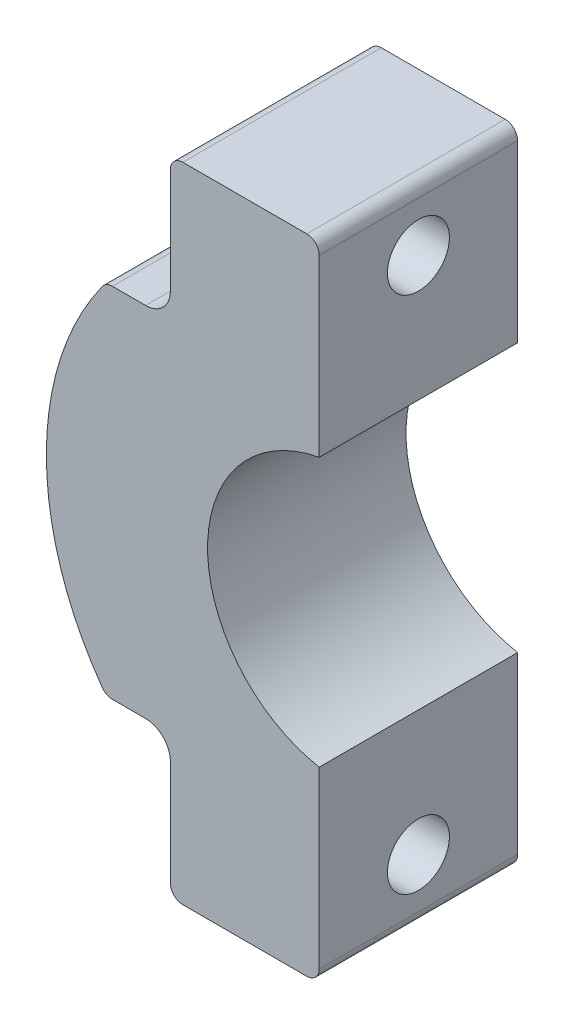
ISO-10303-21;
HEADER;
FILE_DESCRIPTION(('STEP AP214'),'2;1');
FILE_NAME('part.step','',(''),(''),'','','');
FILE_SCHEMA(('AUTOMOTIVE_DESIGN { 1 0 10303 214 1 1 1 1 }'));
ENDSEC;
DATA;
#1=APPLICATION_CONTEXT('core data for automotive mechanical design processes');
#2=APPLICATION_PROTOCOL_DEFINITION('international standard','automotive_design',2000,#1);
#3=PRODUCT_CONTEXT('',#1,'mechanical');
#4=PRODUCT('Part','Part','',(#3));
#5=PRODUCT_RELATED_PRODUCT_CATEGORY('part','',(#4));
#6=PRODUCT_DEFINITION_FORMATION('','',#4);
#7=PRODUCT_DEFINITION_CONTEXT('part definition',#1,'design');
#8=PRODUCT_DEFINITION('design','',#6,#7);
#9=PRODUCT_DEFINITION_SHAPE('','',#8);
#10=(LENGTH_UNIT() NAMED_UNIT(*) SI_UNIT(.MILLI.,.METRE.));
#11=(NAMED_UNIT(*) PLANE_ANGLE_UNIT() SI_UNIT($,.RADIAN.));
#12=(NAMED_UNIT(*) SI_UNIT($,.STERADIAN.) SOLID_ANGLE_UNIT());
#13=UNCERTAINTY_MEASURE_WITH_UNIT(LENGTH_MEASURE(1.E-05),#10,'distance_accuracy_value','');
#14=(GEOMETRIC_REPRESENTATION_CONTEXT(3) GLOBAL_UNCERTAINTY_ASSIGNED_CONTEXT((#13)) GLOBAL_UNIT_ASSIGNED_CONTEXT((#10,
#11,#12)) REPRESENTATION_CONTEXT('',''));
#15=CARTESIAN_POINT('',(0.,0.,0.));
#16=DIRECTION('',(0.,0.,1.));
#17=DIRECTION('',(1.,0.,0.));
#18=AXIS2_PLACEMENT_3D('',#15,#16,#17);
#19=CARTESIAN_POINT('',(0.,0.,8.));
#20=DIRECTION('',(0.,0.,1.));
#21=DIRECTION('',(1.,0.,0.));
#22=AXIS2_PLACEMENT_3D('',#19,#20,#21);
#23=PLANE('',#22);
#24=DIRECTION('',(-1.,0.,0.));
#25=VECTOR('',#24,1.);
#26=CARTESIAN_POINT('',(-7.,-12.9614813968157,8.));
#27=LINE('',#26,#25);
#28=CARTESIAN_POINT('',(-1.5,-12.9614813968157,8.));
#29=VERTEX_POINT('',#28);
#30=CARTESIAN_POINT('',(-6.5,-12.9614813968157,8.));
#31=VERTEX_POINT('',#30);
#32=EDGE_CURVE('E277',#29,#31,#27,.T.);
#33=ORIENTED_EDGE('',*,*,#32,.F.);
#34=CARTESIAN_POINT('',(-1.5,-12.4614813968157,8.));
#35=DIRECTION('',(0.,0.,1.));
#36=DIRECTION('',(1.,0.,0.));
#37=AXIS2_PLACEMENT_3D('',#34,#35,#36);
#38=CIRCLE('',#37,0.5);
#39=CARTESIAN_POINT('',(-1.,-12.4614813968157,8.));
#40=VERTEX_POINT('',#39);
#41=EDGE_CURVE('E177',#29,#40,#38,.T.);
#42=ORIENTED_EDGE('',*,*,#41,.T.);
#43=DIRECTION('',(0.,-1.,0.));
#44=VECTOR('',#43,1.);
#45=CARTESIAN_POINT('',(-1.,24.2431667663396,8.));
#46=LINE('',#45,#44);
#47=CARTESIAN_POINT('',(-1.,-5.40832691319598,8.));
#48=VERTEX_POINT('',#47);
#49=EDGE_CURVE('E162',#48,#40,#46,.T.);
#50=ORIENTED_EDGE('',*,*,#49,.F.);
#51=CARTESIAN_POINT('',(0.,0.,8.));
#52=DIRECTION('',(0.,0.,1.));
#53=DIRECTION('',(1.,0.,0.));
#54=AXIS2_PLACEMENT_3D('',#51,#52,#53);
#55=CIRCLE('',#54,5.5);
#56=CARTESIAN_POINT('',(-1.,5.40832691319598,8.));
#57=VERTEX_POINT('',#56);
#58=EDGE_CURVE('E171',#57,#48,#55,.T.);
#59=ORIENTED_EDGE('',*,*,#58,.F.);
#60=CARTESIAN_POINT('',(-1.,12.4614813968157,8.));
#61=VERTEX_POINT('',#60);
#62=EDGE_CURVE('E178',#61,#57,#46,.T.);
#63=ORIENTED_EDGE('',*,*,#62,.F.);
#64=CARTESIAN_POINT('',(-1.5,12.4614813968157,8.));
#65=DIRECTION('',(0.,0.,1.));
#66=DIRECTION('',(1.,0.,0.));
#67=AXIS2_PLACEMENT_3D('',#64,#65,#66);
#68=CIRCLE('',#67,0.5);
#69=CARTESIAN_POINT('',(-1.5,12.9614813968157,8.));
#70=VERTEX_POINT('',#69);
#71=EDGE_CURVE('E259',#61,#70,#68,.T.);
#72=ORIENTED_EDGE('',*,*,#71,.T.);
#73=DIRECTION('',(1.,0.,0.));
#74=VECTOR('',#73,1.);
#75=CARTESIAN_POINT('',(-7.,12.9614813968157,8.));
#76=LINE('',#75,#74);
#77=CARTESIAN_POINT('',(-6.5,12.9614813968157,8.));
#78=VERTEX_POINT('',#77);
#79=EDGE_CURVE('E273',#78,#70,#76,.T.);
#80=ORIENTED_EDGE('',*,*,#79,.F.);
#81=CARTESIAN_POINT('',(-6.5,12.4614813968157,8.));
#82=DIRECTION('',(0.,0.,1.));
#83=DIRECTION('',(1.,0.,0.));
#84=AXIS2_PLACEMENT_3D('',#81,#82,#83);
#85=CIRCLE('',#84,0.5);
#86=CARTESIAN_POINT('',(-7.,12.4614813968157,8.));
#87=VERTEX_POINT('',#86);
#88=EDGE_CURVE('E227',#78,#87,#85,.T.);
#89=ORIENTED_EDGE('',*,*,#88,.T.);
#90=DIRECTION('',(0.,1.,0.));
#91=VECTOR('',#90,1.);
#92=CARTESIAN_POINT('',(-7.,21.0444914195402,8.));
#93=LINE('',#92,#91);
#94=CARTESIAN_POINT('',(-7.,8.21148139681573,8.));
#95=VERTEX_POINT('',#94);
#96=EDGE_CURVE('E293',#95,#87,#93,.T.);
#97=ORIENTED_EDGE('',*,*,#96,.F.);
#98=CARTESIAN_POINT('',(-8.,8.21148139681572,8.));
#99=DIRECTION('',(0.,0.,1.));
#100=DIRECTION('',(1.,0.,0.));
#101=AXIS2_PLACEMENT_3D('',#98,#99,#100);
#102=CIRCLE('',#101,1.);
#103=CARTESIAN_POINT('',(-8.,7.21148139681572,8.));
#104=VERTEX_POINT('',#103);
#105=EDGE_CURVE('E252',#95,#104,#102,.F.);
#106=ORIENTED_EDGE('',*,*,#105,.T.);
#107=DIRECTION('',(1.,0.,0.));
#108=VECTOR('',#107,1.);
#109=CARTESIAN_POINT('',(-28.8712300204423,7.21148139681572,8.));
#110=LINE('',#109,#108);
#111=CARTESIAN_POINT('',(-9.3384162179781,7.21148139681572,8.));
#112=VERTEX_POINT('',#111);
#113=EDGE_CURVE('E295',#112,#104,#110,.T.);
#114=ORIENTED_EDGE('',*,*,#113,.F.);
#115=CARTESIAN_POINT('',(-9.33841621797811,6.71148139681572,8.));
#116=DIRECTION('',(0.,0.,1.));
#117=DIRECTION('',(1.,0.,0.));
#118=AXIS2_PLACEMENT_3D('',#115,#116,#117);
#119=CIRCLE('',#118,0.5);
#120=CARTESIAN_POINT('',(-9.74443431441194,7.00328493580771,8.));
#121=VERTEX_POINT('',#120);
#122=EDGE_CURVE('E202',#112,#121,#119,.T.);
#123=ORIENTED_EDGE('',*,*,#122,.T.);
#124=CARTESIAN_POINT('',(0.,0.,8.));
#125=DIRECTION('',(0.,0.,-1.));
#126=DIRECTION('',(1.,0.,0.));
#127=AXIS2_PLACEMENT_3D('',#124,#125,#126);
#128=CIRCLE('',#127,12.);
#129=CARTESIAN_POINT('',(-9.74443431441194,-7.00328493580771,8.));
#130=VERTEX_POINT('',#129);
#131=EDGE_CURVE('E279',#130,#121,#128,.T.);
#132=ORIENTED_EDGE('',*,*,#131,.F.);
#133=CARTESIAN_POINT('',(-9.33841621797811,-6.71148139681572,8.));
#134=DIRECTION('',(0.,0.,1.));
#135=DIRECTION('',(1.,0.,0.));
#136=AXIS2_PLACEMENT_3D('',#133,#134,#135);
#137=CIRCLE('',#136,0.5);
#138=CARTESIAN_POINT('',(-9.33841621797811,-7.21148139681572,8.));
#139=VERTEX_POINT('',#138);
#140=EDGE_CURVE('E204',#130,#139,#137,.T.);
#141=ORIENTED_EDGE('',*,*,#140,.T.);
#142=DIRECTION('',(-1.,0.,0.));
#143=VECTOR('',#142,1.);
#144=CARTESIAN_POINT('',(-7.,-7.21148139681572,8.));
#145=LINE('',#144,#143);
#146=CARTESIAN_POINT('',(-8.,-7.21148139681572,8.));
#147=VERTEX_POINT('',#146);
#148=EDGE_CURVE('E303',#147,#139,#145,.T.);
#149=ORIENTED_EDGE('',*,*,#148,.F.);
#150=CARTESIAN_POINT('',(-8.,-8.21148139681572,8.));
#151=DIRECTION('',(0.,0.,1.));
#152=DIRECTION('',(1.,0.,0.));
#153=AXIS2_PLACEMENT_3D('',#150,#151,#152);
#154=CIRCLE('',#153,1.);
#155=CARTESIAN_POINT('',(-7.,-8.21148139681572,8.));
#156=VERTEX_POINT('',#155);
#157=EDGE_CURVE('E248',#147,#156,#154,.F.);
#158=ORIENTED_EDGE('',*,*,#157,.T.);
#159=DIRECTION('',(0.,1.,0.));
#160=VECTOR('',#159,1.);
#161=CARTESIAN_POINT('',(-7.,-7.21148139681572,8.));
#162=LINE('',#161,#160);
#163=CARTESIAN_POINT('',(-7.,-12.4614813968157,8.));
#164=VERTEX_POINT('',#163);
#165=EDGE_CURVE('E287',#164,#156,#162,.T.);
#166=ORIENTED_EDGE('',*,*,#165,.F.);
#167=CARTESIAN_POINT('',(-6.5,-12.4614813968157,8.));
#168=DIRECTION('',(0.,0.,1.));
#169=DIRECTION('',(1.,0.,0.));
#170=AXIS2_PLACEMENT_3D('',#167,#168,#169);
#171=CIRCLE('',#170,0.5);
#172=EDGE_CURVE('E230',#164,#31,#171,.T.);
#173=ORIENTED_EDGE('',*,*,#172,.T.);
#174=EDGE_LOOP('',(#33,#42,#50,#59,#63,#72,#80,#89,#97,#106,#114,#123,#132,#141,#149,#158,#166,#173));
#175=FACE_BOUND('',#174,.T.);
#176=ADVANCED_FACE('F35',(#175),#23,.T.);
#177=CARTESIAN_POINT('',(0.,0.,0.));
#178=DIRECTION('',(0.,0.,1.));
#179=DIRECTION('',(1.,0.,0.));
#180=AXIS2_PLACEMENT_3D('',#177,#178,#179);
#181=PLANE('',#180);
#182=DIRECTION('',(0.,-1.,0.));
#183=VECTOR('',#182,1.);
#184=CARTESIAN_POINT('',(-1.,24.2431667663396,0.));
#185=LINE('',#184,#183);
#186=CARTESIAN_POINT('',(-1.,-5.40832691319598,0.));
#187=VERTEX_POINT('',#186);
#188=CARTESIAN_POINT('',(-1.,-12.4614813968157,0.));
#189=VERTEX_POINT('',#188);
#190=EDGE_CURVE('E165',#187,#189,#185,.T.);
#191=ORIENTED_EDGE('',*,*,#190,.T.);
#192=CARTESIAN_POINT('',(-1.5,-12.4614813968157,0.));
#193=DIRECTION('',(0.,0.,1.));
#194=DIRECTION('',(1.,0.,0.));
#195=AXIS2_PLACEMENT_3D('',#192,#193,#194);
#196=CIRCLE('',#195,0.5);
#197=CARTESIAN_POINT('',(-1.5,-12.9614813968157,0.));
#198=VERTEX_POINT('',#197);
#199=EDGE_CURVE('E265',#189,#198,#196,.F.);
#200=ORIENTED_EDGE('',*,*,#199,.T.);
#201=DIRECTION('',(-1.,0.,0.));
#202=VECTOR('',#201,1.);
#203=CARTESIAN_POINT('',(-7.,-12.9614813968157,0.));
#204=LINE('',#203,#202);
#205=CARTESIAN_POINT('',(-6.5,-12.9614813968157,0.));
#206=VERTEX_POINT('',#205);
#207=EDGE_CURVE('E218',#198,#206,#204,.T.);
#208=ORIENTED_EDGE('',*,*,#207,.T.);
#209=CARTESIAN_POINT('',(-6.5,-12.4614813968157,0.));
#210=DIRECTION('',(0.,0.,1.));
#211=DIRECTION('',(1.,0.,0.));
#212=AXIS2_PLACEMENT_3D('',#209,#210,#211);
#213=CIRCLE('',#212,0.5);
#214=CARTESIAN_POINT('',(-7.,-12.4614813968157,0.));
#215=VERTEX_POINT('',#214);
#216=EDGE_CURVE('E223',#206,#215,#213,.F.);
#217=ORIENTED_EDGE('',*,*,#216,.T.);
#218=DIRECTION('',(0.,1.,0.));
#219=VECTOR('',#218,1.);
#220=CARTESIAN_POINT('',(-7.,-7.21148139681572,0.));
#221=LINE('',#220,#219);
#222=CARTESIAN_POINT('',(-7.,-8.21148139681572,0.));
#223=VERTEX_POINT('',#222);
#224=EDGE_CURVE('E300',#215,#223,#221,.T.);
#225=ORIENTED_EDGE('',*,*,#224,.T.);
#226=CARTESIAN_POINT('',(-8.,-8.21148139681572,0.));
#227=DIRECTION('',(0.,0.,1.));
#228=DIRECTION('',(1.,0.,0.));
#229=AXIS2_PLACEMENT_3D('',#226,#227,#228);
#230=CIRCLE('',#229,1.);
#231=CARTESIAN_POINT('',(-8.,-7.21148139681572,0.));
#232=VERTEX_POINT('',#231);
#233=EDGE_CURVE('E250',#223,#232,#230,.T.);
#234=ORIENTED_EDGE('',*,*,#233,.T.);
#235=DIRECTION('',(-1.,0.,0.));
#236=VECTOR('',#235,1.);
#237=CARTESIAN_POINT('',(-7.,-7.21148139681572,0.));
#238=LINE('',#237,#236);
#239=CARTESIAN_POINT('',(-9.33841621797811,-7.21148139681572,0.));
#240=VERTEX_POINT('',#239);
#241=EDGE_CURVE('E298',#232,#240,#238,.T.);
#242=ORIENTED_EDGE('',*,*,#241,.T.);
#243=CARTESIAN_POINT('',(-9.33841621797811,-6.71148139681572,0.));
#244=DIRECTION('',(0.,0.,1.));
#245=DIRECTION('',(1.,0.,0.));
#246=AXIS2_PLACEMENT_3D('',#243,#244,#245);
#247=CIRCLE('',#246,0.5);
#248=CARTESIAN_POINT('',(-9.74443431441194,-7.00328493580771,0.));
#249=VERTEX_POINT('',#248);
#250=EDGE_CURVE('E196',#240,#249,#247,.F.);
#251=ORIENTED_EDGE('',*,*,#250,.T.);
#252=CARTESIAN_POINT('',(0.,0.,0.));
#253=DIRECTION('',(0.,0.,-1.));
#254=DIRECTION('',(1.,0.,0.));
#255=AXIS2_PLACEMENT_3D('',#252,#253,#254);
#256=CIRCLE('',#255,12.);
#257=CARTESIAN_POINT('',(-9.74443431441194,7.00328493580771,0.));
#258=VERTEX_POINT('',#257);
#259=EDGE_CURVE('E284',#249,#258,#256,.T.);
#260=ORIENTED_EDGE('',*,*,#259,.T.);
#261=CARTESIAN_POINT('',(-9.33841621797811,6.71148139681572,0.));
#262=DIRECTION('',(0.,0.,1.));
#263=DIRECTION('',(1.,0.,0.));
#264=AXIS2_PLACEMENT_3D('',#261,#262,#263);
#265=CIRCLE('',#264,0.5);
#266=CARTESIAN_POINT('',(-9.3384162179781,7.21148139681572,0.));
#267=VERTEX_POINT('',#266);
#268=EDGE_CURVE('E194',#258,#267,#265,.F.);
#269=ORIENTED_EDGE('',*,*,#268,.T.);
#270=DIRECTION('',(1.,0.,0.));
#271=VECTOR('',#270,1.);
#272=CARTESIAN_POINT('',(-28.8712300204423,7.21148139681572,0.));
#273=LINE('',#272,#271);
#274=CARTESIAN_POINT('',(-8.,7.21148139681572,0.));
#275=VERTEX_POINT('',#274);
#276=EDGE_CURVE('E290',#267,#275,#273,.T.);
#277=ORIENTED_EDGE('',*,*,#276,.T.);
#278=CARTESIAN_POINT('',(-8.,8.21148139681572,0.));
#279=DIRECTION('',(0.,0.,1.));
#280=DIRECTION('',(1.,0.,0.));
#281=AXIS2_PLACEMENT_3D('',#278,#279,#280);
#282=CIRCLE('',#281,1.);
#283=CARTESIAN_POINT('',(-7.,8.21148139681573,0.));
#284=VERTEX_POINT('',#283);
#285=EDGE_CURVE('E254',#275,#284,#282,.T.);
#286=ORIENTED_EDGE('',*,*,#285,.T.);
#287=DIRECTION('',(0.,1.,0.));
#288=VECTOR('',#287,1.);
#289=CARTESIAN_POINT('',(-7.,21.0444914195402,0.));
#290=LINE('',#289,#288);
#291=CARTESIAN_POINT('',(-7.,12.4614813968157,0.));
#292=VERTEX_POINT('',#291);
#293=EDGE_CURVE('E179',#284,#292,#290,.T.);
#294=ORIENTED_EDGE('',*,*,#293,.T.);
#295=CARTESIAN_POINT('',(-6.5,12.4614813968157,0.));
#296=DIRECTION('',(0.,0.,1.));
#297=DIRECTION('',(1.,0.,0.));
#298=AXIS2_PLACEMENT_3D('',#295,#296,#297);
#299=CIRCLE('',#298,0.5);
#300=CARTESIAN_POINT('',(-6.5,12.9614813968157,0.));
#301=VERTEX_POINT('',#300);
#302=EDGE_CURVE('E221',#292,#301,#299,.F.);
#303=ORIENTED_EDGE('',*,*,#302,.T.);
#304=DIRECTION('',(1.,0.,0.));
#305=VECTOR('',#304,1.);
#306=CARTESIAN_POINT('',(-7.,12.9614813968157,0.));
#307=LINE('',#306,#305);
#308=CARTESIAN_POINT('',(-1.5,12.9614813968157,0.));
#309=VERTEX_POINT('',#308);
#310=EDGE_CURVE('E270',#301,#309,#307,.T.);
#311=ORIENTED_EDGE('',*,*,#310,.T.);
#312=CARTESIAN_POINT('',(-1.5,12.4614813968157,0.));
#313=DIRECTION('',(0.,0.,1.));
#314=DIRECTION('',(1.,0.,0.));
#315=AXIS2_PLACEMENT_3D('',#312,#313,#314);
#316=CIRCLE('',#315,0.5);
#317=CARTESIAN_POINT('',(-1.,12.4614813968157,0.));
#318=VERTEX_POINT('',#317);
#319=EDGE_CURVE('E50',#309,#318,#316,.F.);
#320=ORIENTED_EDGE('',*,*,#319,.T.);
#321=CARTESIAN_POINT('',(-1.,5.40832691319598,0.));
#322=VERTEX_POINT('',#321);
#323=EDGE_CURVE('E186',#318,#322,#185,.T.);
#324=ORIENTED_EDGE('',*,*,#323,.T.);
#325=CARTESIAN_POINT('',(0.,0.,0.));
#326=DIRECTION('',(0.,0.,1.));
#327=DIRECTION('',(1.,0.,0.));
#328=AXIS2_PLACEMENT_3D('',#325,#326,#327);
#329=CIRCLE('',#328,5.5);
#330=EDGE_CURVE('E184',#322,#187,#329,.T.);
#331=ORIENTED_EDGE('',*,*,#330,.T.);
#332=EDGE_LOOP('',(#191,#200,#208,#217,#225,#234,#242,#251,#260,#269,#277,#286,#294,#303,#311,
#320,#324,#331));
#333=FACE_BOUND('',#332,.T.);
#334=ADVANCED_FACE('F275',(#333),#181,.F.);
#335=CARTESIAN_POINT('',(0.,0.,8.));
#336=DIRECTION('',(0.,0.,-1.));
#337=DIRECTION('',(-1.,0.,0.));
#338=AXIS2_PLACEMENT_3D('',#335,#336,#337);
#339=CYLINDRICAL_SURFACE('',#338,5.5);
#340=DIRECTION('',(0.,0.,-1.));
#341=VECTOR('',#340,1.);
#342=CARTESIAN_POINT('',(-1.,5.40832691319598,8.));
#343=LINE('',#342,#341);
#344=EDGE_CURVE('E170',#57,#322,#343,.T.);
#345=ORIENTED_EDGE('',*,*,#344,.F.);
#346=ORIENTED_EDGE('',*,*,#58,.T.);
#347=DIRECTION('',(0.,0.,-1.));
#348=VECTOR('',#347,1.);
#349=CARTESIAN_POINT('',(-1.,-5.40832691319598,8.));
#350=LINE('',#349,#348);
#351=EDGE_CURVE('E159',#187,#48,#350,.F.);
#352=ORIENTED_EDGE('',*,*,#351,.F.);
#353=ORIENTED_EDGE('',*,*,#330,.F.);
#354=EDGE_LOOP('',(#345,#346,#352,#353));
#355=FACE_BOUND('',#354,.T.);
#356=ADVANCED_FACE('F182',(#355),#339,.F.);
#357=CARTESIAN_POINT('',(-1.,24.2431667663396,0.));
#358=DIRECTION('',(-1.,0.,0.));
#359=DIRECTION('',(0.,-1.,0.));
#360=AXIS2_PLACEMENT_3D('',#357,#358,#359);
#361=PLANE('',#360);
#362=CARTESIAN_POINT('',(-1.,-10.4614813968157,4.));
#363=DIRECTION('',(1.,0.,0.));
#364=DIRECTION('',(0.,1.,0.));
#365=AXIS2_PLACEMENT_3D('',#362,#363,#364);
#366=CIRCLE('',#365,1.25);
#367=CARTESIAN_POINT('',(-1.,-9.21148139681572,4.));
#368=VERTEX_POINT('',#367);
#369=EDGE_CURVE('E395',#368,#368,#366,.T.);
#370=ORIENTED_EDGE('',*,*,#369,.F.);
#371=EDGE_LOOP('',(#370));
#372=FACE_BOUND('',#371,.T.);
#373=ORIENTED_EDGE('',*,*,#49,.T.);
#374=DIRECTION('',(0.,0.,1.));
#375=VECTOR('',#374,1.);
#376=CARTESIAN_POINT('',(-1.,-12.4614813968157,0.));
#377=LINE('',#376,#375);
#378=EDGE_CURVE('E262',#40,#189,#377,.F.);
#379=ORIENTED_EDGE('',*,*,#378,.T.);
#380=ORIENTED_EDGE('',*,*,#190,.F.);
#381=ORIENTED_EDGE('',*,*,#351,.T.);
#382=EDGE_LOOP('',(#373,#379,#380,#381));
#383=FACE_BOUND('',#382,.T.);
#384=ADVANCED_FACE('F161',(#372,#383),#361,.F.);
#385=CARTESIAN_POINT('',(-1.,10.4614813968157,4.));
#386=DIRECTION('',(1.,0.,0.));
#387=DIRECTION('',(0.,1.,0.));
#388=AXIS2_PLACEMENT_3D('',#385,#386,#387);
#389=CIRCLE('',#388,1.25);
#390=CARTESIAN_POINT('',(-1.,11.7114813968157,4.));
#391=VERTEX_POINT('',#390);
#392=EDGE_CURVE('E215',#391,#391,#389,.T.);
#393=ORIENTED_EDGE('',*,*,#392,.F.);
#394=EDGE_LOOP('',(#393));
#395=FACE_BOUND('',#394,.T.);
#396=ORIENTED_EDGE('',*,*,#323,.F.);
#397=DIRECTION('',(0.,0.,-1.));
#398=VECTOR('',#397,1.);
#399=CARTESIAN_POINT('',(-1.,12.4614813968157,8.));
#400=LINE('',#399,#398);
#401=EDGE_CURVE('E11',#318,#61,#400,.F.);
#402=ORIENTED_EDGE('',*,*,#401,.T.);
#403=ORIENTED_EDGE('',*,*,#62,.T.);
#404=ORIENTED_EDGE('',*,*,#344,.T.);
#405=EDGE_LOOP('',(#396,#402,#403,#404));
#406=FACE_BOUND('',#405,.T.);
#407=ADVANCED_FACE('F309',(#395,#406),#361,.F.);
#408=CARTESIAN_POINT('',(-7.,-7.21148139681572,0.));
#409=DIRECTION('',(0.,1.,0.));
#410=DIRECTION('',(-1.,0.,0.));
#411=AXIS2_PLACEMENT_3D('',#408,#409,#410);
#412=PLANE('',#411);
#413=ORIENTED_EDGE('',*,*,#241,.F.);
#414=DIRECTION('',(0.,0.,1.));
#415=VECTOR('',#414,1.);
#416=CARTESIAN_POINT('',(-8.,-7.21148139681572,8.));
#417=LINE('',#416,#415);
#418=EDGE_CURVE('E238',#232,#147,#417,.T.);
#419=ORIENTED_EDGE('',*,*,#418,.T.);
#420=ORIENTED_EDGE('',*,*,#148,.T.);
#421=DIRECTION('',(0.,0.,1.));
#422=VECTOR('',#421,1.);
#423=CARTESIAN_POINT('',(-9.33841621797811,-7.21148139681572,0.));
#424=LINE('',#423,#422);
#425=EDGE_CURVE('E191',#139,#240,#424,.F.);
#426=ORIENTED_EDGE('',*,*,#425,.T.);
#427=EDGE_LOOP('',(#413,#419,#420,#426));
#428=FACE_BOUND('',#427,.T.);
#429=ADVANCED_FACE('F379',(#428),#412,.F.);
#430=CARTESIAN_POINT('',(-7.,-7.21148139681572,0.));
#431=DIRECTION('',(1.,0.,0.));
#432=DIRECTION('',(0.,1.,0.));
#433=AXIS2_PLACEMENT_3D('',#430,#431,#432);
#434=PLANE('',#433);
#435=CARTESIAN_POINT('',(-7.,-10.4614813968157,4.));
#436=DIRECTION('',(1.,0.,0.));
#437=DIRECTION('',(0.,1.,0.));
#438=AXIS2_PLACEMENT_3D('',#435,#436,#437);
#439=CIRCLE('',#438,1.25);
#440=CARTESIAN_POINT('',(-7.,-9.21148139681572,4.));
#441=VERTEX_POINT('',#440);
#442=EDGE_CURVE('E214',#441,#441,#439,.T.);
#443=ORIENTED_EDGE('',*,*,#442,.T.);
#444=EDGE_LOOP('',(#443));
#445=FACE_BOUND('',#444,.T.);
#446=ORIENTED_EDGE('',*,*,#165,.T.);
#447=DIRECTION('',(0.,0.,1.));
#448=VECTOR('',#447,1.);
#449=CARTESIAN_POINT('',(-7.,-8.21148139681572,0.));
#450=LINE('',#449,#448);
#451=EDGE_CURVE('E241',#156,#223,#450,.F.);
#452=ORIENTED_EDGE('',*,*,#451,.T.);
#453=ORIENTED_EDGE('',*,*,#224,.F.);
#454=DIRECTION('',(0.,0.,-1.));
#455=VECTOR('',#454,1.);
#456=CARTESIAN_POINT('',(-7.,-12.4614813968157,8.));
#457=LINE('',#456,#455);
#458=EDGE_CURVE('E225',#215,#164,#457,.F.);
#459=ORIENTED_EDGE('',*,*,#458,.T.);
#460=EDGE_LOOP('',(#446,#452,#453,#459));
#461=FACE_BOUND('',#460,.T.);
#462=ADVANCED_FACE('F385',(#445,#461),#434,.F.);
#463=CARTESIAN_POINT('',(-28.8712300204423,7.21148139681572,0.));
#464=DIRECTION('',(0.,-1.,0.));
#465=DIRECTION('',(0.,0.,-1.));
#466=AXIS2_PLACEMENT_3D('',#463,#464,#465);
#467=PLANE('',#466);
#468=ORIENTED_EDGE('',*,*,#113,.T.);
#469=DIRECTION('',(0.,0.,1.));
#470=VECTOR('',#469,1.);
#471=CARTESIAN_POINT('',(-8.,7.21148139681572,0.));
#472=LINE('',#471,#470);
#473=EDGE_CURVE('E246',#104,#275,#472,.F.);
#474=ORIENTED_EDGE('',*,*,#473,.T.);
#475=ORIENTED_EDGE('',*,*,#276,.F.);
#476=DIRECTION('',(0.,0.,1.));
#477=VECTOR('',#476,1.);
#478=CARTESIAN_POINT('',(-9.3384162179781,7.21148139681572,0.));
#479=LINE('',#478,#477);
#480=EDGE_CURVE('E207',#267,#112,#479,.T.);
#481=ORIENTED_EDGE('',*,*,#480,.T.);
#482=EDGE_LOOP('',(#468,#474,#475,#481));
#483=FACE_BOUND('',#482,.T.);
#484=ADVANCED_FACE('F364',(#483),#467,.F.);
#485=CARTESIAN_POINT('',(-7.,21.0444914195402,0.));
#486=DIRECTION('',(1.,0.,0.));
#487=DIRECTION('',(0.,0.,-1.));
#488=AXIS2_PLACEMENT_3D('',#485,#486,#487);
#489=PLANE('',#488);
#490=CARTESIAN_POINT('',(-7.,10.4614813968157,4.));
#491=DIRECTION('',(1.,0.,0.));
#492=DIRECTION('',(0.,0.,-1.));
#493=AXIS2_PLACEMENT_3D('',#490,#491,#492);
#494=CIRCLE('',#493,1.25);
#495=CARTESIAN_POINT('',(-7.,10.4614813968157,2.75));
#496=VERTEX_POINT('',#495);
#497=EDGE_CURVE('E211',#496,#496,#494,.T.);
#498=ORIENTED_EDGE('',*,*,#497,.T.);
#499=EDGE_LOOP('',(#498));
#500=FACE_BOUND('',#499,.T.);
#501=ORIENTED_EDGE('',*,*,#293,.F.);
#502=DIRECTION('',(0.,0.,1.));
#503=VECTOR('',#502,1.);
#504=CARTESIAN_POINT('',(-7.,8.21148139681572,8.));
#505=LINE('',#504,#503);
#506=EDGE_CURVE('E243',#284,#95,#505,.T.);
#507=ORIENTED_EDGE('',*,*,#506,.T.);
#508=ORIENTED_EDGE('',*,*,#96,.T.);
#509=DIRECTION('',(0.,0.,-1.));
#510=VECTOR('',#509,1.);
#511=CARTESIAN_POINT('',(-7.,12.4614813968157,0.));
#512=LINE('',#511,#510);
#513=EDGE_CURVE('E233',#87,#292,#512,.T.);
#514=ORIENTED_EDGE('',*,*,#513,.T.);
#515=EDGE_LOOP('',(#501,#507,#508,#514));
#516=FACE_BOUND('',#515,.T.);
#517=ADVANCED_FACE('F358',(#500,#516),#489,.F.);
#518=CARTESIAN_POINT('',(0.,0.,0.));
#519=DIRECTION('',(0.,0.,1.));
#520=DIRECTION('',(1.,0.,0.));
#521=AXIS2_PLACEMENT_3D('',#518,#519,#520);
#522=CYLINDRICAL_SURFACE('',#521,12.);
#523=ORIENTED_EDGE('',*,*,#259,.F.);
#524=DIRECTION('',(0.,0.,1.));
#525=VECTOR('',#524,1.);
#526=CARTESIAN_POINT('',(-9.74443431441194,-7.00328493580771,0.));
#527=LINE('',#526,#525);
#528=EDGE_CURVE('E200',#249,#130,#527,.T.);
#529=ORIENTED_EDGE('',*,*,#528,.T.);
#530=ORIENTED_EDGE('',*,*,#131,.T.);
#531=DIRECTION('',(0.,0.,1.));
#532=VECTOR('',#531,1.);
#533=CARTESIAN_POINT('',(-9.74443431441194,7.00328493580771,0.));
#534=LINE('',#533,#532);
#535=EDGE_CURVE('E198',#121,#258,#534,.F.);
#536=ORIENTED_EDGE('',*,*,#535,.T.);
#537=EDGE_LOOP('',(#523,#529,#530,#536));
#538=FACE_BOUND('',#537,.T.);
#539=ADVANCED_FACE('F330',(#538),#522,.T.);
#540=CARTESIAN_POINT('',(-9.33841621797811,-6.71148139681572,0.));
#541=DIRECTION('',(0.,0.,1.));
#542=DIRECTION('',(1.,0.,0.));
#543=AXIS2_PLACEMENT_3D('',#540,#541,#542);
#544=CYLINDRICAL_SURFACE('',#543,0.5);
#545=ORIENTED_EDGE('',*,*,#140,.F.);
#546=ORIENTED_EDGE('',*,*,#528,.F.);
#547=ORIENTED_EDGE('',*,*,#250,.F.);
#548=ORIENTED_EDGE('',*,*,#425,.F.);
#549=EDGE_LOOP('',(#545,#546,#547,#548));
#550=FACE_BOUND('',#549,.T.);
#551=ADVANCED_FACE('F326',(#550),#544,.T.);
#552=CARTESIAN_POINT('',(-9.33841621797811,6.71148139681572,0.));
#553=DIRECTION('',(0.,0.,1.));
#554=DIRECTION('',(1.,0.,0.));
#555=AXIS2_PLACEMENT_3D('',#552,#553,#554);
#556=CYLINDRICAL_SURFACE('',#555,0.5);
#557=ORIENTED_EDGE('',*,*,#268,.F.);
#558=ORIENTED_EDGE('',*,*,#535,.F.);
#559=ORIENTED_EDGE('',*,*,#122,.F.);
#560=ORIENTED_EDGE('',*,*,#480,.F.);
#561=EDGE_LOOP('',(#557,#558,#559,#560));
#562=FACE_BOUND('',#561,.T.);
#563=ADVANCED_FACE('F329',(#562),#556,.T.);
#564=CARTESIAN_POINT('',(-7.,12.9614813968157,8.));
#565=DIRECTION('',(0.,1.,0.));
#566=DIRECTION('',(0.,0.,1.));
#567=AXIS2_PLACEMENT_3D('',#564,#565,#566);
#568=PLANE('',#567);
#569=ORIENTED_EDGE('',*,*,#79,.T.);
#570=DIRECTION('',(0.,0.,-1.));
#571=VECTOR('',#570,1.);
#572=CARTESIAN_POINT('',(-1.5,12.9614813968157,0.));
#573=LINE('',#572,#571);
#574=EDGE_CURVE('E43',#70,#309,#573,.T.);
#575=ORIENTED_EDGE('',*,*,#574,.T.);
#576=ORIENTED_EDGE('',*,*,#310,.F.);
#577=DIRECTION('',(0.,0.,-1.));
#578=VECTOR('',#577,1.);
#579=CARTESIAN_POINT('',(-6.5,12.9614813968157,8.));
#580=LINE('',#579,#578);
#581=EDGE_CURVE('E236',#301,#78,#580,.F.);
#582=ORIENTED_EDGE('',*,*,#581,.T.);
#583=EDGE_LOOP('',(#569,#575,#576,#582));
#584=FACE_BOUND('',#583,.T.);
#585=ADVANCED_FACE('F269',(#584),#568,.T.);
#586=CARTESIAN_POINT('',(-7.,-12.9614813968157,8.));
#587=DIRECTION('',(0.,-1.,0.));
#588=DIRECTION('',(0.,0.,-1.));
#589=AXIS2_PLACEMENT_3D('',#586,#587,#588);
#590=PLANE('',#589);
#591=ORIENTED_EDGE('',*,*,#207,.F.);
#592=DIRECTION('',(0.,0.,1.));
#593=VECTOR('',#592,1.);
#594=CARTESIAN_POINT('',(-1.5,-12.9614813968157,8.));
#595=LINE('',#594,#593);
#596=EDGE_CURVE('E256',#198,#29,#595,.T.);
#597=ORIENTED_EDGE('',*,*,#596,.T.);
#598=ORIENTED_EDGE('',*,*,#32,.T.);
#599=DIRECTION('',(0.,0.,-1.));
#600=VECTOR('',#599,1.);
#601=CARTESIAN_POINT('',(-6.5,-12.9614813968157,0.));
#602=LINE('',#601,#600);
#603=EDGE_CURVE('E210',#31,#206,#602,.T.);
#604=ORIENTED_EDGE('',*,*,#603,.T.);
#605=EDGE_LOOP('',(#591,#597,#598,#604));
#606=FACE_BOUND('',#605,.T.);
#607=ADVANCED_FACE('F392',(#606),#590,.T.);
#608=CARTESIAN_POINT('',(-9.,10.4614813968157,4.));
#609=DIRECTION('',(1.,0.,0.));
#610=DIRECTION('',(0.,1.,0.));
#611=AXIS2_PLACEMENT_3D('',#608,#609,#610);
#612=CYLINDRICAL_SURFACE('',#611,1.25);
#613=ORIENTED_EDGE('',*,*,#392,.T.);
#614=EDGE_LOOP('',(#613));
#615=FACE_BOUND('',#614,.T.);
#616=ORIENTED_EDGE('',*,*,#497,.F.);
#617=EDGE_LOOP('',(#616));
#618=FACE_BOUND('',#617,.T.);
#619=ADVANCED_FACE('F401',(#615,#618),#612,.F.);
#620=CARTESIAN_POINT('',(-9.,-10.4614813968157,4.));
#621=DIRECTION('',(1.,0.,0.));
#622=DIRECTION('',(0.,1.,0.));
#623=AXIS2_PLACEMENT_3D('',#620,#621,#622);
#624=CYLINDRICAL_SURFACE('',#623,1.25);
#625=ORIENTED_EDGE('',*,*,#369,.T.);
#626=EDGE_LOOP('',(#625));
#627=FACE_BOUND('',#626,.T.);
#628=ORIENTED_EDGE('',*,*,#442,.F.);
#629=EDGE_LOOP('',(#628));
#630=FACE_BOUND('',#629,.T.);
#631=ADVANCED_FACE('F339',(#627,#630),#624,.F.);
#632=CARTESIAN_POINT('',(-6.5,-12.4614813968157,8.));
#633=DIRECTION('',(0.,0.,1.));
#634=DIRECTION('',(1.,0.,0.));
#635=AXIS2_PLACEMENT_3D('',#632,#633,#634);
#636=CYLINDRICAL_SURFACE('',#635,0.5);
#637=ORIENTED_EDGE('',*,*,#172,.F.);
#638=ORIENTED_EDGE('',*,*,#458,.F.);
#639=ORIENTED_EDGE('',*,*,#216,.F.);
#640=ORIENTED_EDGE('',*,*,#603,.F.);
#641=EDGE_LOOP('',(#637,#638,#639,#640));
#642=FACE_BOUND('',#641,.T.);
#643=ADVANCED_FACE('F335',(#642),#636,.T.);
#644=CARTESIAN_POINT('',(-6.5,12.4614813968157,0.));
#645=DIRECTION('',(0.,0.,1.));
#646=DIRECTION('',(1.,0.,0.));
#647=AXIS2_PLACEMENT_3D('',#644,#645,#646);
#648=CYLINDRICAL_SURFACE('',#647,0.5);
#649=ORIENTED_EDGE('',*,*,#88,.F.);
#650=ORIENTED_EDGE('',*,*,#581,.F.);
#651=ORIENTED_EDGE('',*,*,#302,.F.);
#652=ORIENTED_EDGE('',*,*,#513,.F.);
#653=EDGE_LOOP('',(#649,#650,#651,#652));
#654=FACE_BOUND('',#653,.T.);
#655=ADVANCED_FACE('F338',(#654),#648,.T.);
#656=CARTESIAN_POINT('',(-8.,-8.21148139681572,0.));
#657=DIRECTION('',(0.,0.,-1.));
#658=DIRECTION('',(-1.,0.,0.));
#659=AXIS2_PLACEMENT_3D('',#656,#657,#658);
#660=CYLINDRICAL_SURFACE('',#659,1.);
#661=ORIENTED_EDGE('',*,*,#233,.F.);
#662=ORIENTED_EDGE('',*,*,#451,.F.);
#663=ORIENTED_EDGE('',*,*,#157,.F.);
#664=ORIENTED_EDGE('',*,*,#418,.F.);
#665=EDGE_LOOP('',(#661,#662,#663,#664));
#666=FACE_BOUND('',#665,.T.);
#667=ADVANCED_FACE('F343',(#666),#660,.F.);
#668=CARTESIAN_POINT('',(-8.,8.21148139681572,0.));
#669=DIRECTION('',(0.,0.,-1.));
#670=DIRECTION('',(-1.,0.,0.));
#671=AXIS2_PLACEMENT_3D('',#668,#669,#670);
#672=CYLINDRICAL_SURFACE('',#671,1.);
#673=ORIENTED_EDGE('',*,*,#285,.F.);
#674=ORIENTED_EDGE('',*,*,#473,.F.);
#675=ORIENTED_EDGE('',*,*,#105,.F.);
#676=ORIENTED_EDGE('',*,*,#506,.F.);
#677=EDGE_LOOP('',(#673,#674,#675,#676));
#678=FACE_BOUND('',#677,.T.);
#679=ADVANCED_FACE('F315',(#678),#672,.F.);
#680=CARTESIAN_POINT('',(-1.5,-12.4614813968157,8.));
#681=DIRECTION('',(0.,0.,-1.));
#682=DIRECTION('',(-1.,0.,0.));
#683=AXIS2_PLACEMENT_3D('',#680,#681,#682);
#684=CYLINDRICAL_SURFACE('',#683,0.5);
#685=ORIENTED_EDGE('',*,*,#199,.F.);
#686=ORIENTED_EDGE('',*,*,#378,.F.);
#687=ORIENTED_EDGE('',*,*,#41,.F.);
#688=ORIENTED_EDGE('',*,*,#596,.F.);
#689=EDGE_LOOP('',(#685,#686,#687,#688));
#690=FACE_BOUND('',#689,.T.);
#691=ADVANCED_FACE('F311',(#690),#684,.T.);
#692=CARTESIAN_POINT('',(-1.5,12.4614813968157,8.));
#693=DIRECTION('',(0.,0.,1.));
#694=DIRECTION('',(1.,0.,0.));
#695=AXIS2_PLACEMENT_3D('',#692,#693,#694);
#696=CYLINDRICAL_SURFACE('',#695,0.5);
#697=ORIENTED_EDGE('',*,*,#71,.F.);
#698=ORIENTED_EDGE('',*,*,#401,.F.);
#699=ORIENTED_EDGE('',*,*,#319,.F.);
#700=ORIENTED_EDGE('',*,*,#574,.F.);
#701=EDGE_LOOP('',(#697,#698,#699,#700));
#702=FACE_BOUND('',#701,.T.);
#703=ADVANCED_FACE('F37',(#702),#696,.T.);
#704=CLOSED_SHELL('',(#176,#334,#356,#384,#407,#429,#462,#484,#517,#539,#551,#563,#585,#607,
#619,#631,#643,#655,#667,#679,#691,#703));
#705=MANIFOLD_SOLID_BREP('B2',#704);
#706=ADVANCED_BREP_SHAPE_REPRESENTATION('',(#18,#705),#14);
#707=SHAPE_DEFINITION_REPRESENTATION(#9,#706);
ENDSEC;
END-ISO-10303-21;
